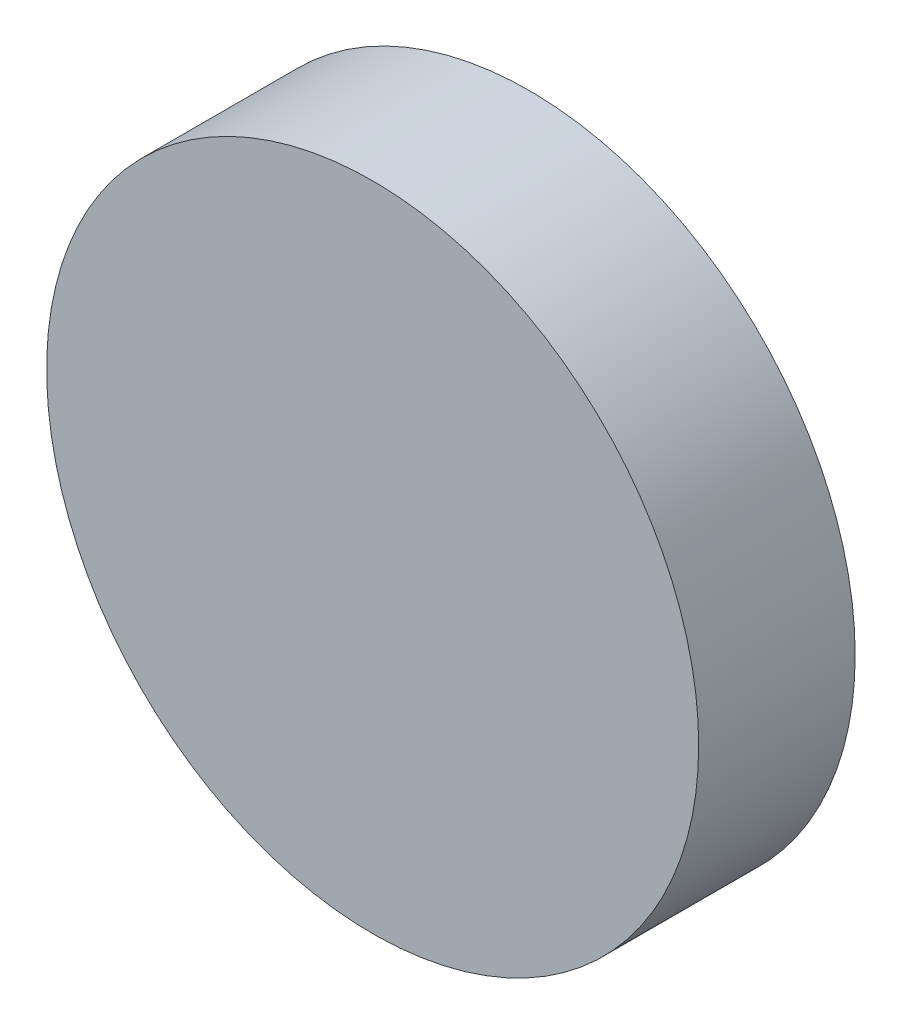
ISO-10303-21;
HEADER;
FILE_DESCRIPTION(('STEP AP214'),'2;1');
FILE_NAME('part.step','',(''),(''),'','','');
FILE_SCHEMA(('AUTOMOTIVE_DESIGN { 1 0 10303 214 1 1 1 1 }'));
ENDSEC;
DATA;
#1=APPLICATION_CONTEXT('core data for automotive mechanical design processes');
#2=APPLICATION_PROTOCOL_DEFINITION('international standard','automotive_design',2000,#1);
#3=PRODUCT_CONTEXT('',#1,'mechanical');
#4=PRODUCT('Part','Part','',(#3));
#5=PRODUCT_RELATED_PRODUCT_CATEGORY('part','',(#4));
#6=PRODUCT_DEFINITION_FORMATION('','',#4);
#7=PRODUCT_DEFINITION_CONTEXT('part definition',#1,'design');
#8=PRODUCT_DEFINITION('design','',#6,#7);
#9=PRODUCT_DEFINITION_SHAPE('','',#8);
#10=(LENGTH_UNIT() NAMED_UNIT(*) SI_UNIT(.MILLI.,.METRE.));
#11=(NAMED_UNIT(*) PLANE_ANGLE_UNIT() SI_UNIT($,.RADIAN.));
#12=(NAMED_UNIT(*) SI_UNIT($,.STERADIAN.) SOLID_ANGLE_UNIT());
#13=UNCERTAINTY_MEASURE_WITH_UNIT(LENGTH_MEASURE(1.E-05),#10,'distance_accuracy_value','');
#14=(GEOMETRIC_REPRESENTATION_CONTEXT(3) GLOBAL_UNCERTAINTY_ASSIGNED_CONTEXT((#13)) GLOBAL_UNIT_ASSIGNED_CONTEXT((#10,
#11,#12)) REPRESENTATION_CONTEXT('',''));
#15=CARTESIAN_POINT('',(0.,0.,0.));
#16=DIRECTION('',(0.,0.,1.));
#17=DIRECTION('',(1.,0.,0.));
#18=AXIS2_PLACEMENT_3D('',#15,#16,#17);
#19=CARTESIAN_POINT('',(0.,0.,6.));
#20=DIRECTION('',(0.,0.,-1.));
#21=DIRECTION('',(-1.,0.,0.));
#22=AXIS2_PLACEMENT_3D('',#19,#20,#21);
#23=CYLINDRICAL_SURFACE('',#22,12.5);
#24=CARTESIAN_POINT('',(0.,0.,6.));
#25=DIRECTION('',(0.,0.,1.));
#26=DIRECTION('',(1.,0.,0.));
#27=AXIS2_PLACEMENT_3D('',#24,#25,#26);
#28=CIRCLE('',#27,12.5);
#29=CARTESIAN_POINT('',(12.5,0.,6.));
#30=VERTEX_POINT('',#29);
#31=EDGE_CURVE('E10',#30,#30,#28,.T.);
#32=ORIENTED_EDGE('',*,*,#31,.F.);
#33=EDGE_LOOP('',(#32));
#34=FACE_BOUND('',#33,.T.);
#35=CARTESIAN_POINT('',(0.,0.,0.));
#36=DIRECTION('',(0.,0.,1.));
#37=DIRECTION('',(1.,0.,0.));
#38=AXIS2_PLACEMENT_3D('',#35,#36,#37);
#39=CIRCLE('',#38,12.5);
#40=CARTESIAN_POINT('',(12.5,0.,0.));
#41=VERTEX_POINT('',#40);
#42=EDGE_CURVE('E38',#41,#41,#39,.T.);
#43=ORIENTED_EDGE('',*,*,#42,.T.);
#44=EDGE_LOOP('',(#43));
#45=FACE_BOUND('',#44,.T.);
#46=ADVANCED_FACE('F35',(#34,#45),#23,.T.);
#47=CARTESIAN_POINT('',(0.,0.,6.));
#48=DIRECTION('',(0.,0.,1.));
#49=DIRECTION('',(1.,0.,0.));
#50=AXIS2_PLACEMENT_3D('',#47,#48,#49);
#51=PLANE('',#50);
#52=ORIENTED_EDGE('',*,*,#31,.T.);
#53=EDGE_LOOP('',(#52));
#54=FACE_BOUND('',#53,.T.);
#55=ADVANCED_FACE('F50',(#54),#51,.T.);
#56=CARTESIAN_POINT('',(0.,0.,0.));
#57=DIRECTION('',(0.,0.,1.));
#58=DIRECTION('',(1.,0.,0.));
#59=AXIS2_PLACEMENT_3D('',#56,#57,#58);
#60=PLANE('',#59);
#61=ORIENTED_EDGE('',*,*,#42,.F.);
#62=EDGE_LOOP('',(#61));
#63=FACE_BOUND('',#62,.T.);
#64=ADVANCED_FACE('F48',(#63),#60,.F.);
#65=CLOSED_SHELL('',(#46,#55,#64));
#66=MANIFOLD_SOLID_BREP('B2',#65);
#67=ADVANCED_BREP_SHAPE_REPRESENTATION('',(#18,#66),#14);
#68=SHAPE_DEFINITION_REPRESENTATION(#9,#67);
ENDSEC;
END-ISO-10303-21;
